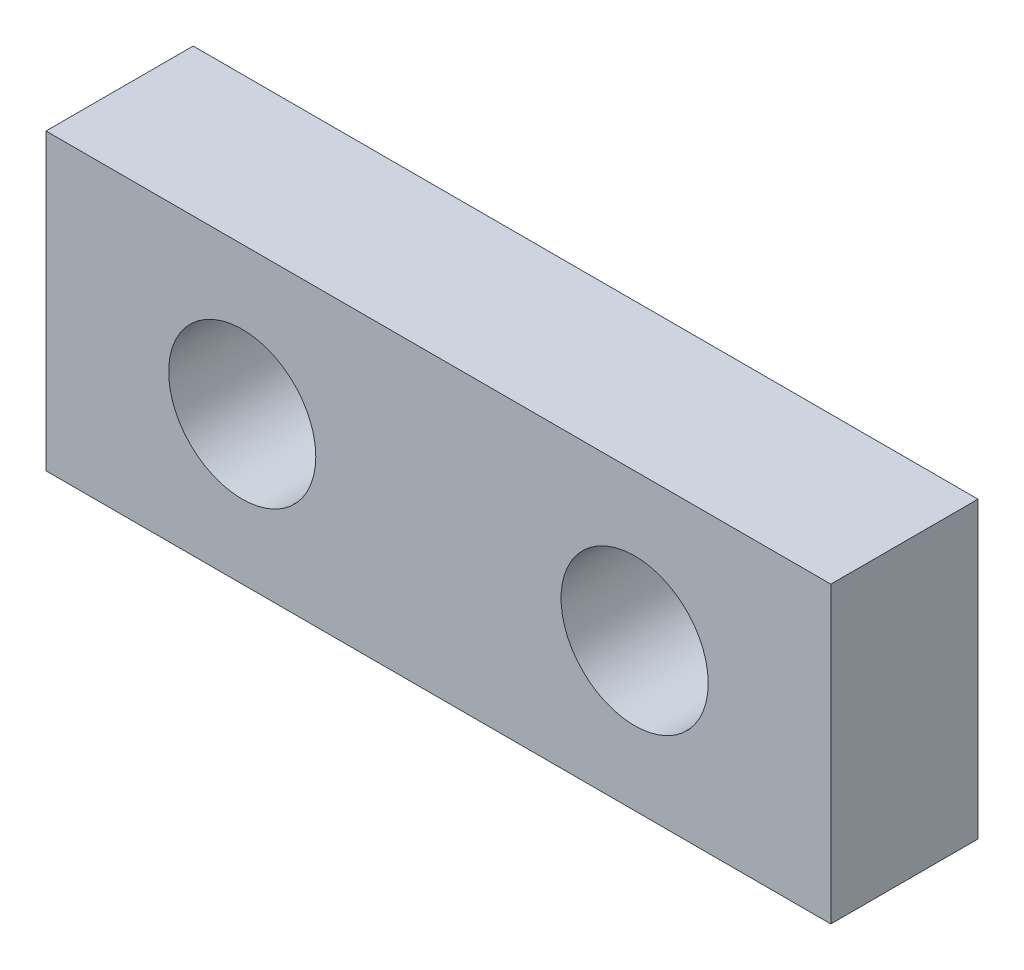
ISO-10303-21;
HEADER;
FILE_DESCRIPTION(('STEP AP214'),'2;1');
FILE_NAME('part.step','',(''),(''),'','','');
FILE_SCHEMA(('AUTOMOTIVE_DESIGN { 1 0 10303 214 1 1 1 1 }'));
ENDSEC;
DATA;
#1=APPLICATION_CONTEXT('core data for automotive mechanical design processes');
#2=APPLICATION_PROTOCOL_DEFINITION('international standard','automotive_design',2000,#1);
#3=PRODUCT_CONTEXT('',#1,'mechanical');
#4=PRODUCT('Part','Part','',(#3));
#5=PRODUCT_RELATED_PRODUCT_CATEGORY('part','',(#4));
#6=PRODUCT_DEFINITION_FORMATION('','',#4);
#7=PRODUCT_DEFINITION_CONTEXT('part definition',#1,'design');
#8=PRODUCT_DEFINITION('design','',#6,#7);
#9=PRODUCT_DEFINITION_SHAPE('','',#8);
#10=(LENGTH_UNIT() NAMED_UNIT(*) SI_UNIT(.MILLI.,.METRE.));
#11=(NAMED_UNIT(*) PLANE_ANGLE_UNIT() SI_UNIT($,.RADIAN.));
#12=(NAMED_UNIT(*) SI_UNIT($,.STERADIAN.) SOLID_ANGLE_UNIT());
#13=UNCERTAINTY_MEASURE_WITH_UNIT(LENGTH_MEASURE(1.E-05),#10,'distance_accuracy_value','');
#14=(GEOMETRIC_REPRESENTATION_CONTEXT(3) GLOBAL_UNCERTAINTY_ASSIGNED_CONTEXT((#13)) GLOBAL_UNIT_ASSIGNED_CONTEXT((#10,
#11,#12)) REPRESENTATION_CONTEXT('',''));
#15=CARTESIAN_POINT('',(0.,0.,0.));
#16=DIRECTION('',(0.,0.,1.));
#17=DIRECTION('',(1.,0.,0.));
#18=AXIS2_PLACEMENT_3D('',#15,#16,#17);
#19=CARTESIAN_POINT('',(8.,3.,3.));
#20=DIRECTION('',(-1.,0.,0.));
#21=DIRECTION('',(0.,0.,1.));
#22=AXIS2_PLACEMENT_3D('',#19,#20,#21);
#23=PLANE('',#22);
#24=DIRECTION('',(0.,1.,0.));
#25=VECTOR('',#24,1.);
#26=CARTESIAN_POINT('',(8.,3.,0.));
#27=LINE('',#26,#25);
#28=CARTESIAN_POINT('',(8.,-3.,0.));
#29=VERTEX_POINT('',#28);
#30=CARTESIAN_POINT('',(8.,3.,0.));
#31=VERTEX_POINT('',#30);
#32=EDGE_CURVE('E107',#29,#31,#27,.T.);
#33=ORIENTED_EDGE('',*,*,#32,.T.);
#34=DIRECTION('',(0.,0.,-1.));
#35=VECTOR('',#34,1.);
#36=CARTESIAN_POINT('',(8.,3.,3.));
#37=LINE('',#36,#35);
#38=CARTESIAN_POINT('',(8.,3.,3.));
#39=VERTEX_POINT('',#38);
#40=EDGE_CURVE('E11',#39,#31,#37,.T.);
#41=ORIENTED_EDGE('',*,*,#40,.F.);
#42=DIRECTION('',(0.,1.,0.));
#43=VECTOR('',#42,1.);
#44=CARTESIAN_POINT('',(8.,3.,3.));
#45=LINE('',#44,#43);
#46=CARTESIAN_POINT('',(8.,-3.,3.));
#47=VERTEX_POINT('',#46);
#48=EDGE_CURVE('E91',#47,#39,#45,.T.);
#49=ORIENTED_EDGE('',*,*,#48,.F.);
#50=DIRECTION('',(0.,0.,-1.));
#51=VECTOR('',#50,1.);
#52=CARTESIAN_POINT('',(8.,-3.,3.));
#53=LINE('',#52,#51);
#54=EDGE_CURVE('E103',#47,#29,#53,.T.);
#55=ORIENTED_EDGE('',*,*,#54,.T.);
#56=EDGE_LOOP('',(#33,#41,#49,#55));
#57=FACE_BOUND('',#56,.T.);
#58=ADVANCED_FACE('F39',(#57),#23,.F.);
#59=CARTESIAN_POINT('',(-8.,3.,3.));
#60=DIRECTION('',(0.,-1.,0.));
#61=DIRECTION('',(0.,0.,-1.));
#62=AXIS2_PLACEMENT_3D('',#59,#60,#61);
#63=PLANE('',#62);
#64=DIRECTION('',(-1.,0.,0.));
#65=VECTOR('',#64,1.);
#66=CARTESIAN_POINT('',(-8.,3.,0.));
#67=LINE('',#66,#65);
#68=CARTESIAN_POINT('',(-8.,3.,0.));
#69=VERTEX_POINT('',#68);
#70=EDGE_CURVE('E96',#31,#69,#67,.T.);
#71=ORIENTED_EDGE('',*,*,#70,.T.);
#72=DIRECTION('',(0.,0.,-1.));
#73=VECTOR('',#72,1.);
#74=CARTESIAN_POINT('',(-8.,3.,3.));
#75=LINE('',#74,#73);
#76=CARTESIAN_POINT('',(-8.,3.,3.));
#77=VERTEX_POINT('',#76);
#78=EDGE_CURVE('E48',#77,#69,#75,.T.);
#79=ORIENTED_EDGE('',*,*,#78,.F.);
#80=DIRECTION('',(-1.,0.,0.));
#81=VECTOR('',#80,1.);
#82=CARTESIAN_POINT('',(-8.,3.,3.));
#83=LINE('',#82,#81);
#84=EDGE_CURVE('E86',#39,#77,#83,.T.);
#85=ORIENTED_EDGE('',*,*,#84,.F.);
#86=ORIENTED_EDGE('',*,*,#40,.T.);
#87=EDGE_LOOP('',(#71,#79,#85,#86));
#88=FACE_BOUND('',#87,.T.);
#89=ADVANCED_FACE('F95',(#88),#63,.F.);
#90=CARTESIAN_POINT('',(-8.,3.,3.));
#91=DIRECTION('',(1.,0.,0.));
#92=DIRECTION('',(0.,0.,-1.));
#93=AXIS2_PLACEMENT_3D('',#90,#91,#92);
#94=PLANE('',#93);
#95=DIRECTION('',(0.,-1.,0.));
#96=VECTOR('',#95,1.);
#97=CARTESIAN_POINT('',(-8.,3.,0.));
#98=LINE('',#97,#96);
#99=CARTESIAN_POINT('',(-8.,-3.,0.));
#100=VERTEX_POINT('',#99);
#101=EDGE_CURVE('E73',#69,#100,#98,.T.);
#102=ORIENTED_EDGE('',*,*,#101,.T.);
#103=DIRECTION('',(0.,0.,-1.));
#104=VECTOR('',#103,1.);
#105=CARTESIAN_POINT('',(-8.,-3.,3.));
#106=LINE('',#105,#104);
#107=CARTESIAN_POINT('',(-8.,-3.,3.));
#108=VERTEX_POINT('',#107);
#109=EDGE_CURVE('E98',#108,#100,#106,.T.);
#110=ORIENTED_EDGE('',*,*,#109,.F.);
#111=DIRECTION('',(0.,-1.,0.));
#112=VECTOR('',#111,1.);
#113=CARTESIAN_POINT('',(-8.,3.,3.));
#114=LINE('',#113,#112);
#115=EDGE_CURVE('E89',#77,#108,#114,.T.);
#116=ORIENTED_EDGE('',*,*,#115,.F.);
#117=ORIENTED_EDGE('',*,*,#78,.T.);
#118=EDGE_LOOP('',(#102,#110,#116,#117));
#119=FACE_BOUND('',#118,.T.);
#120=ADVANCED_FACE('F99',(#119),#94,.F.);
#121=CARTESIAN_POINT('',(-8.,-3.,3.));
#122=DIRECTION('',(0.,1.,0.));
#123=DIRECTION('',(0.,0.,1.));
#124=AXIS2_PLACEMENT_3D('',#121,#122,#123);
#125=PLANE('',#124);
#126=DIRECTION('',(1.,0.,0.));
#127=VECTOR('',#126,1.);
#128=CARTESIAN_POINT('',(-8.,-3.,0.));
#129=LINE('',#128,#127);
#130=EDGE_CURVE('E79',#100,#29,#129,.T.);
#131=ORIENTED_EDGE('',*,*,#130,.T.);
#132=ORIENTED_EDGE('',*,*,#54,.F.);
#133=DIRECTION('',(1.,0.,0.));
#134=VECTOR('',#133,1.);
#135=CARTESIAN_POINT('',(-8.,-3.,3.));
#136=LINE('',#135,#134);
#137=EDGE_CURVE('E56',#108,#47,#136,.T.);
#138=ORIENTED_EDGE('',*,*,#137,.F.);
#139=ORIENTED_EDGE('',*,*,#109,.T.);
#140=EDGE_LOOP('',(#131,#132,#138,#139));
#141=FACE_BOUND('',#140,.T.);
#142=ADVANCED_FACE('F121',(#141),#125,.F.);
#143=CARTESIAN_POINT('',(0.,0.,3.));
#144=DIRECTION('',(0.,0.,1.));
#145=DIRECTION('',(1.,0.,0.));
#146=AXIS2_PLACEMENT_3D('',#143,#144,#145);
#147=PLANE('',#146);
#148=CARTESIAN_POINT('',(-4.,0.,3.));
#149=DIRECTION('',(0.,0.,1.));
#150=DIRECTION('',(1.,0.,0.));
#151=AXIS2_PLACEMENT_3D('',#148,#149,#150);
#152=CIRCLE('',#151,1.5);
#153=CARTESIAN_POINT('',(-2.5,0.,3.));
#154=VERTEX_POINT('',#153);
#155=EDGE_CURVE('E136',#154,#154,#152,.T.);
#156=ORIENTED_EDGE('',*,*,#155,.F.);
#157=EDGE_LOOP('',(#156));
#158=FACE_BOUND('',#157,.T.);
#159=CARTESIAN_POINT('',(4.,0.,3.));
#160=DIRECTION('',(0.,0.,1.));
#161=DIRECTION('',(1.,0.,0.));
#162=AXIS2_PLACEMENT_3D('',#159,#160,#161);
#163=CIRCLE('',#162,1.5);
#164=CARTESIAN_POINT('',(5.5,0.,3.));
#165=VERTEX_POINT('',#164);
#166=EDGE_CURVE('E128',#165,#165,#163,.T.);
#167=ORIENTED_EDGE('',*,*,#166,.F.);
#168=EDGE_LOOP('',(#167));
#169=FACE_BOUND('',#168,.T.);
#170=ORIENTED_EDGE('',*,*,#48,.T.);
#171=ORIENTED_EDGE('',*,*,#84,.T.);
#172=ORIENTED_EDGE('',*,*,#115,.T.);
#173=ORIENTED_EDGE('',*,*,#137,.T.);
#174=EDGE_LOOP('',(#170,#171,#172,#173));
#175=FACE_BOUND('',#174,.T.);
#176=ADVANCED_FACE('F87',(#158,#169,#175),#147,.T.);
#177=CARTESIAN_POINT('',(0.,0.,0.));
#178=DIRECTION('',(0.,0.,1.));
#179=DIRECTION('',(1.,0.,0.));
#180=AXIS2_PLACEMENT_3D('',#177,#178,#179);
#181=PLANE('',#180);
#182=CARTESIAN_POINT('',(-4.,0.,0.));
#183=DIRECTION('',(0.,0.,1.));
#184=DIRECTION('',(1.,0.,0.));
#185=AXIS2_PLACEMENT_3D('',#182,#183,#184);
#186=CIRCLE('',#185,1.5);
#187=CARTESIAN_POINT('',(-2.5,0.,0.));
#188=VERTEX_POINT('',#187);
#189=EDGE_CURVE('E111',#188,#188,#186,.T.);
#190=ORIENTED_EDGE('',*,*,#189,.T.);
#191=EDGE_LOOP('',(#190));
#192=FACE_BOUND('',#191,.T.);
#193=CARTESIAN_POINT('',(4.,0.,0.));
#194=DIRECTION('',(0.,0.,1.));
#195=DIRECTION('',(1.,0.,0.));
#196=AXIS2_PLACEMENT_3D('',#193,#194,#195);
#197=CIRCLE('',#196,1.5);
#198=CARTESIAN_POINT('',(5.5,0.,0.));
#199=VERTEX_POINT('',#198);
#200=EDGE_CURVE('E132',#199,#199,#197,.T.);
#201=ORIENTED_EDGE('',*,*,#200,.T.);
#202=EDGE_LOOP('',(#201));
#203=FACE_BOUND('',#202,.T.);
#204=ORIENTED_EDGE('',*,*,#32,.F.);
#205=ORIENTED_EDGE('',*,*,#130,.F.);
#206=ORIENTED_EDGE('',*,*,#101,.F.);
#207=ORIENTED_EDGE('',*,*,#70,.F.);
#208=EDGE_LOOP('',(#204,#205,#206,#207));
#209=FACE_BOUND('',#208,.T.);
#210=ADVANCED_FACE('F124',(#192,#203,#209),#181,.F.);
#211=CARTESIAN_POINT('',(4.,0.,0.));
#212=DIRECTION('',(0.,0.,1.));
#213=DIRECTION('',(1.,0.,0.));
#214=AXIS2_PLACEMENT_3D('',#211,#212,#213);
#215=CYLINDRICAL_SURFACE('',#214,1.5);
#216=ORIENTED_EDGE('',*,*,#200,.F.);
#217=EDGE_LOOP('',(#216));
#218=FACE_BOUND('',#217,.T.);
#219=ORIENTED_EDGE('',*,*,#166,.T.);
#220=EDGE_LOOP('',(#219));
#221=FACE_BOUND('',#220,.T.);
#222=ADVANCED_FACE('F149',(#218,#221),#215,.F.);
#223=CARTESIAN_POINT('',(-4.,0.,0.));
#224=DIRECTION('',(0.,0.,1.));
#225=DIRECTION('',(1.,0.,0.));
#226=AXIS2_PLACEMENT_3D('',#223,#224,#225);
#227=CYLINDRICAL_SURFACE('',#226,1.5);
#228=ORIENTED_EDGE('',*,*,#189,.F.);
#229=EDGE_LOOP('',(#228));
#230=FACE_BOUND('',#229,.T.);
#231=ORIENTED_EDGE('',*,*,#155,.T.);
#232=EDGE_LOOP('',(#231));
#233=FACE_BOUND('',#232,.T.);
#234=ADVANCED_FACE('F146',(#230,#233),#227,.F.);
#235=CLOSED_SHELL('',(#58,#89,#120,#142,#176,#210,#222,#234));
#236=MANIFOLD_SOLID_BREP('B2',#235);
#237=ADVANCED_BREP_SHAPE_REPRESENTATION('',(#18,#236),#14);
#238=SHAPE_DEFINITION_REPRESENTATION(#9,#237);
ENDSEC;
END-ISO-10303-21;
